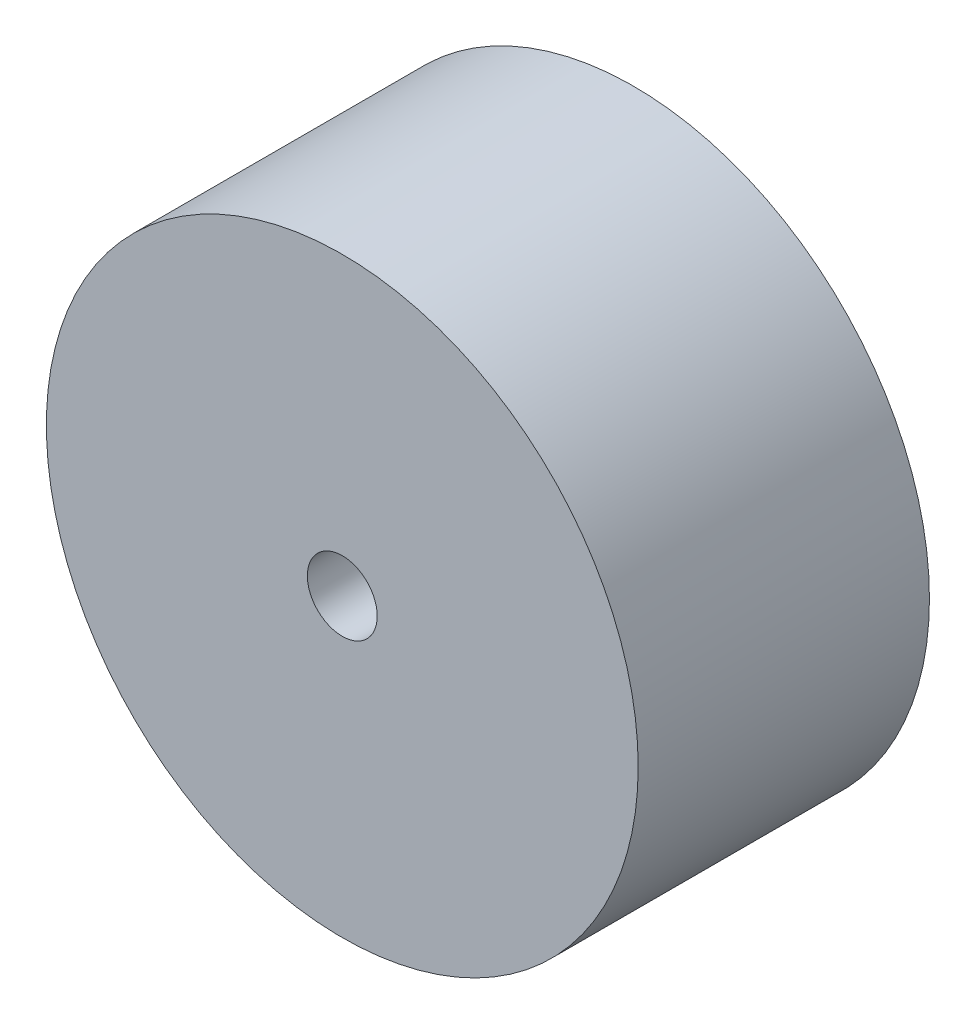
ISO-10303-21;
HEADER;
FILE_DESCRIPTION(('STEP AP214'),'2;1');
FILE_NAME('part.step','',(''),(''),'','','');
FILE_SCHEMA(('AUTOMOTIVE_DESIGN { 1 0 10303 214 1 1 1 1 }'));
ENDSEC;
DATA;
#1=APPLICATION_CONTEXT('core data for automotive mechanical design processes');
#2=APPLICATION_PROTOCOL_DEFINITION('international standard','automotive_design',2000,#1);
#3=PRODUCT_CONTEXT('',#1,'mechanical');
#4=PRODUCT('Part','Part','',(#3));
#5=PRODUCT_RELATED_PRODUCT_CATEGORY('part','',(#4));
#6=PRODUCT_DEFINITION_FORMATION('','',#4);
#7=PRODUCT_DEFINITION_CONTEXT('part definition',#1,'design');
#8=PRODUCT_DEFINITION('design','',#6,#7);
#9=PRODUCT_DEFINITION_SHAPE('','',#8);
#10=(LENGTH_UNIT() NAMED_UNIT(*) SI_UNIT(.MILLI.,.METRE.));
#11=(NAMED_UNIT(*) PLANE_ANGLE_UNIT() SI_UNIT($,.RADIAN.));
#12=(NAMED_UNIT(*) SI_UNIT($,.STERADIAN.) SOLID_ANGLE_UNIT());
#13=UNCERTAINTY_MEASURE_WITH_UNIT(LENGTH_MEASURE(1.E-05),#10,'distance_accuracy_value','');
#14=(GEOMETRIC_REPRESENTATION_CONTEXT(3) GLOBAL_UNCERTAINTY_ASSIGNED_CONTEXT((#13)) GLOBAL_UNIT_ASSIGNED_CONTEXT((#10,
#11,#12)) REPRESENTATION_CONTEXT('',''));
#15=CARTESIAN_POINT('',(0.,0.,0.));
#16=DIRECTION('',(0.,0.,1.));
#17=DIRECTION('',(1.,0.,0.));
#18=AXIS2_PLACEMENT_3D('',#15,#16,#17);
#19=CARTESIAN_POINT('',(0.,0.,25.));
#20=DIRECTION('',(0.,0.,1.));
#21=DIRECTION('',(1.,0.,0.));
#22=AXIS2_PLACEMENT_3D('',#19,#20,#21);
#23=PLANE('',#22);
#24=CARTESIAN_POINT('',(0.,0.,25.));
#25=DIRECTION('',(0.,0.,1.));
#26=DIRECTION('',(1.,0.,0.));
#27=AXIS2_PLACEMENT_3D('',#24,#25,#26);
#28=CIRCLE('',#27,50.8);
#29=CARTESIAN_POINT('',(50.8,0.,25.));
#30=VERTEX_POINT('',#29);
#31=EDGE_CURVE('E10',#30,#30,#28,.T.);
#32=ORIENTED_EDGE('',*,*,#31,.T.);
#33=EDGE_LOOP('',(#32));
#34=FACE_BOUND('',#33,.T.);
#35=CARTESIAN_POINT('',(0.,0.,25.));
#36=DIRECTION('',(0.,0.,1.));
#37=DIRECTION('',(1.,0.,0.));
#38=AXIS2_PLACEMENT_3D('',#35,#36,#37);
#39=CIRCLE('',#38,6.);
#40=CARTESIAN_POINT('',(6.,0.,25.));
#41=VERTEX_POINT('',#40);
#42=EDGE_CURVE('E42',#41,#41,#39,.T.);
#43=ORIENTED_EDGE('',*,*,#42,.F.);
#44=EDGE_LOOP('',(#43));
#45=FACE_BOUND('',#44,.T.);
#46=ADVANCED_FACE('F31',(#34,#45),#23,.T.);
#47=CARTESIAN_POINT('',(0.,0.,-25.));
#48=DIRECTION('',(0.,0.,1.));
#49=DIRECTION('',(1.,0.,0.));
#50=AXIS2_PLACEMENT_3D('',#47,#48,#49);
#51=PLANE('',#50);
#52=CARTESIAN_POINT('',(0.,0.,-25.));
#53=DIRECTION('',(0.,0.,1.));
#54=DIRECTION('',(1.,0.,0.));
#55=AXIS2_PLACEMENT_3D('',#52,#53,#54);
#56=CIRCLE('',#55,50.8);
#57=CARTESIAN_POINT('',(50.8,0.,-25.));
#58=VERTEX_POINT('',#57);
#59=EDGE_CURVE('E35',#58,#58,#56,.T.);
#60=ORIENTED_EDGE('',*,*,#59,.F.);
#61=EDGE_LOOP('',(#60));
#62=FACE_BOUND('',#61,.T.);
#63=CARTESIAN_POINT('',(0.,0.,-25.));
#64=DIRECTION('',(0.,0.,1.));
#65=DIRECTION('',(1.,0.,0.));
#66=AXIS2_PLACEMENT_3D('',#63,#64,#65);
#67=CIRCLE('',#66,6.);
#68=CARTESIAN_POINT('',(6.,0.,-25.));
#69=VERTEX_POINT('',#68);
#70=EDGE_CURVE('E44',#69,#69,#67,.T.);
#71=ORIENTED_EDGE('',*,*,#70,.T.);
#72=EDGE_LOOP('',(#71));
#73=FACE_BOUND('',#72,.T.);
#74=ADVANCED_FACE('F54',(#62,#73),#51,.F.);
#75=CARTESIAN_POINT('',(0.,0.,25.));
#76=DIRECTION('',(0.,0.,-1.));
#77=DIRECTION('',(-1.,0.,0.));
#78=AXIS2_PLACEMENT_3D('',#75,#76,#77);
#79=CYLINDRICAL_SURFACE('',#78,50.8);
#80=ORIENTED_EDGE('',*,*,#31,.F.);
#81=EDGE_LOOP('',(#80));
#82=FACE_BOUND('',#81,.T.);
#83=ORIENTED_EDGE('',*,*,#59,.T.);
#84=EDGE_LOOP('',(#83));
#85=FACE_BOUND('',#84,.T.);
#86=ADVANCED_FACE('F33',(#82,#85),#79,.T.);
#87=CARTESIAN_POINT('',(0.,0.,25.));
#88=DIRECTION('',(0.,0.,-1.));
#89=DIRECTION('',(-1.,0.,0.));
#90=AXIS2_PLACEMENT_3D('',#87,#88,#89);
#91=CYLINDRICAL_SURFACE('',#90,6.);
#92=ORIENTED_EDGE('',*,*,#42,.T.);
#93=EDGE_LOOP('',(#92));
#94=FACE_BOUND('',#93,.T.);
#95=ORIENTED_EDGE('',*,*,#70,.F.);
#96=EDGE_LOOP('',(#95));
#97=FACE_BOUND('',#96,.T.);
#98=ADVANCED_FACE('F50',(#94,#97),#91,.F.);
#99=CLOSED_SHELL('',(#46,#74,#86,#98));
#100=MANIFOLD_SOLID_BREP('B2',#99);
#101=ADVANCED_BREP_SHAPE_REPRESENTATION('',(#18,#100),#14);
#102=SHAPE_DEFINITION_REPRESENTATION(#9,#101);
ENDSEC;
END-ISO-10303-21;
